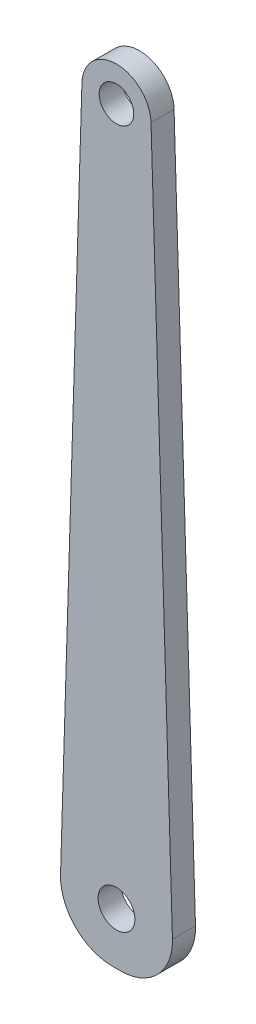
ISO-10303-21;
HEADER;
FILE_DESCRIPTION(('STEP AP214'),'2;1');
FILE_NAME('part.step','',(''),(''),'','','');
FILE_SCHEMA(('AUTOMOTIVE_DESIGN { 1 0 10303 214 1 1 1 1 }'));
ENDSEC;
DATA;
#1=APPLICATION_CONTEXT('core data for automotive mechanical design processes');
#2=APPLICATION_PROTOCOL_DEFINITION('international standard','automotive_design',2000,#1);
#3=PRODUCT_CONTEXT('',#1,'mechanical');
#4=PRODUCT('Part','Part','',(#3));
#5=PRODUCT_RELATED_PRODUCT_CATEGORY('part','',(#4));
#6=PRODUCT_DEFINITION_FORMATION('','',#4);
#7=PRODUCT_DEFINITION_CONTEXT('part definition',#1,'design');
#8=PRODUCT_DEFINITION('design','',#6,#7);
#9=PRODUCT_DEFINITION_SHAPE('','',#8);
#10=(LENGTH_UNIT() NAMED_UNIT(*) SI_UNIT(.MILLI.,.METRE.));
#11=(NAMED_UNIT(*) PLANE_ANGLE_UNIT() SI_UNIT($,.RADIAN.));
#12=(NAMED_UNIT(*) SI_UNIT($,.STERADIAN.) SOLID_ANGLE_UNIT());
#13=UNCERTAINTY_MEASURE_WITH_UNIT(LENGTH_MEASURE(1.E-05),#10,'distance_accuracy_value','');
#14=(GEOMETRIC_REPRESENTATION_CONTEXT(3) GLOBAL_UNCERTAINTY_ASSIGNED_CONTEXT((#13)) GLOBAL_UNIT_ASSIGNED_CONTEXT((#10,
#11,#12)) REPRESENTATION_CONTEXT('',''));
#15=CARTESIAN_POINT('',(0.,0.,0.));
#16=DIRECTION('',(0.,0.,1.));
#17=DIRECTION('',(1.,0.,0.));
#18=AXIS2_PLACEMENT_3D('',#15,#16,#17);
#19=CARTESIAN_POINT('',(0.,0.,-20.));
#20=DIRECTION('',(-0.999527633021855,0.0307328948478349,0.));
#21=DIRECTION('',(-0.0307328948478349,-0.999527633021855,0.));
#22=AXIS2_PLACEMENT_3D('',#19,#20,#21);
#23=PLANE('',#22);
#24=DIRECTION('',(-0.0307328948478349,-0.999527633021855,0.));
#25=VECTOR('',#24,1.);
#26=CARTESIAN_POINT('',(0.,0.,-20.));
#27=LINE('',#26,#25);
#28=CARTESIAN_POINT('',(20.0141710093443,650.921986845435,-20.));
#29=VERTEX_POINT('',#28);
#30=CARTESIAN_POINT('',(1.42615692474724,46.3829802681526,-20.));
#31=VERTEX_POINT('',#30);
#32=EDGE_CURVE('E112',#29,#31,#27,.T.);
#33=ORIENTED_EDGE('',*,*,#32,.T.);
#34=DIRECTION('',(0.,0.,1.));
#35=VECTOR('',#34,1.);
#36=CARTESIAN_POINT('',(1.42615692474724,46.3829802681526,-20.));
#37=LINE('',#36,#35);
#38=CARTESIAN_POINT('',(1.42615692474724,46.3829802681526,0.));
#39=VERTEX_POINT('',#38);
#40=EDGE_CURVE('E11',#31,#39,#37,.T.);
#41=ORIENTED_EDGE('',*,*,#40,.T.);
#42=DIRECTION('',(-0.0307328948478349,-0.999527633021855,0.));
#43=VECTOR('',#42,1.);
#44=CARTESIAN_POINT('',(0.,0.,0.));
#45=LINE('',#44,#43);
#46=CARTESIAN_POINT('',(20.0141710093443,650.921986845435,0.));
#47=VERTEX_POINT('',#46);
#48=EDGE_CURVE('E116',#47,#39,#45,.T.);
#49=ORIENTED_EDGE('',*,*,#48,.F.);
#50=DIRECTION('',(0.,0.,1.));
#51=VECTOR('',#50,1.);
#52=CARTESIAN_POINT('',(20.0141710093443,650.921986845435,-20.));
#53=LINE('',#52,#51);
#54=EDGE_CURVE('E109',#29,#47,#53,.T.);
#55=ORIENTED_EDGE('',*,*,#54,.F.);
#56=EDGE_LOOP('',(#33,#41,#49,#55));
#57=FACE_BOUND('',#56,.T.);
#58=ADVANCED_FACE('F40',(#57),#23,.T.);
#59=CARTESIAN_POINT('',(49.9999999999999,650.,-20.));
#60=DIRECTION('',(0.,0.,1.));
#61=DIRECTION('',(1.,0.,0.));
#62=AXIS2_PLACEMENT_3D('',#59,#60,#61);
#63=CYLINDRICAL_SURFACE('',#62,30.);
#64=CARTESIAN_POINT('',(49.9999999999999,650.,0.));
#65=DIRECTION('',(0.,0.,1.));
#66=DIRECTION('',(1.,0.,0.));
#67=AXIS2_PLACEMENT_3D('',#64,#65,#66);
#68=CIRCLE('',#67,30.);
#69=CARTESIAN_POINT('',(79.9858289906555,650.921986845435,0.));
#70=VERTEX_POINT('',#69);
#71=EDGE_CURVE('E108',#70,#47,#68,.T.);
#72=ORIENTED_EDGE('',*,*,#71,.F.);
#73=DIRECTION('',(0.,0.,1.));
#74=VECTOR('',#73,1.);
#75=CARTESIAN_POINT('',(79.9858289906555,650.921986845435,-20.));
#76=LINE('',#75,#74);
#77=CARTESIAN_POINT('',(79.9858289906555,650.921986845435,-20.));
#78=VERTEX_POINT('',#77);
#79=EDGE_CURVE('E97',#78,#70,#76,.T.);
#80=ORIENTED_EDGE('',*,*,#79,.F.);
#81=CARTESIAN_POINT('',(49.9999999999999,650.,-20.));
#82=DIRECTION('',(0.,0.,1.));
#83=DIRECTION('',(1.,0.,0.));
#84=AXIS2_PLACEMENT_3D('',#81,#82,#83);
#85=CIRCLE('',#84,30.);
#86=EDGE_CURVE('E101',#78,#29,#85,.T.);
#87=ORIENTED_EDGE('',*,*,#86,.T.);
#88=ORIENTED_EDGE('',*,*,#54,.T.);
#89=EDGE_LOOP('',(#72,#80,#87,#88));
#90=FACE_BOUND('',#89,.T.);
#91=ADVANCED_FACE('F106',(#90),#63,.T.);
#92=CARTESIAN_POINT('',(100.,0.,-20.));
#93=DIRECTION('',(0.999527633021855,0.0307328948478351,0.));
#94=DIRECTION('',(-0.0307328948478351,0.999527633021855,0.));
#95=AXIS2_PLACEMENT_3D('',#92,#93,#94);
#96=PLANE('',#95);
#97=DIRECTION('',(-0.0307328948478351,0.999527633021855,0.));
#98=VECTOR('',#97,1.);
#99=CARTESIAN_POINT('',(100.,0.,0.));
#100=LINE('',#99,#98);
#101=CARTESIAN_POINT('',(98.5738430752528,46.3829802681526,0.));
#102=VERTEX_POINT('',#101);
#103=EDGE_CURVE('E123',#102,#70,#100,.T.);
#104=ORIENTED_EDGE('',*,*,#103,.F.);
#105=DIRECTION('',(0.,0.,1.));
#106=VECTOR('',#105,1.);
#107=CARTESIAN_POINT('',(98.5738430752528,46.3829802681526,-20.));
#108=LINE('',#107,#106);
#109=CARTESIAN_POINT('',(98.5738430752528,46.3829802681526,-20.));
#110=VERTEX_POINT('',#109);
#111=EDGE_CURVE('E63',#102,#110,#108,.F.);
#112=ORIENTED_EDGE('',*,*,#111,.T.);
#113=DIRECTION('',(-0.0307328948478351,0.999527633021855,0.));
#114=VECTOR('',#113,1.);
#115=CARTESIAN_POINT('',(100.,0.,-20.));
#116=LINE('',#115,#114);
#117=EDGE_CURVE('E94',#110,#78,#116,.T.);
#118=ORIENTED_EDGE('',*,*,#117,.T.);
#119=ORIENTED_EDGE('',*,*,#79,.T.);
#120=EDGE_LOOP('',(#104,#112,#118,#119));
#121=FACE_BOUND('',#120,.T.);
#122=ADVANCED_FACE('F96',(#121),#96,.T.);
#123=CARTESIAN_POINT('',(0.,0.,-20.));
#124=DIRECTION('',(0.,-1.,0.));
#125=DIRECTION('',(0.,0.,-1.));
#126=AXIS2_PLACEMENT_3D('',#123,#124,#125);
#127=PLANE('',#126);
#128=DIRECTION('',(1.,0.,0.));
#129=VECTOR('',#128,1.);
#130=CARTESIAN_POINT('',(0.,0.,-20.));
#131=LINE('',#130,#129);
#132=CARTESIAN_POINT('',(46.4049004107307,0.,-20.));
#133=VERTEX_POINT('',#132);
#134=CARTESIAN_POINT('',(53.5950995892693,0.,-20.));
#135=VERTEX_POINT('',#134);
#136=EDGE_CURVE('E102',#133,#135,#131,.T.);
#137=ORIENTED_EDGE('',*,*,#136,.T.);
#138=DIRECTION('',(0.,0.,1.));
#139=VECTOR('',#138,1.);
#140=CARTESIAN_POINT('',(53.5950995892693,0.,-20.));
#141=LINE('',#140,#139);
#142=CARTESIAN_POINT('',(53.5950995892693,0.,0.));
#143=VERTEX_POINT('',#142);
#144=EDGE_CURVE('E129',#135,#143,#141,.T.);
#145=ORIENTED_EDGE('',*,*,#144,.T.);
#146=DIRECTION('',(1.,0.,0.));
#147=VECTOR('',#146,1.);
#148=CARTESIAN_POINT('',(0.,0.,0.));
#149=LINE('',#148,#147);
#150=CARTESIAN_POINT('',(46.4049004107307,0.,0.));
#151=VERTEX_POINT('',#150);
#152=EDGE_CURVE('E119',#151,#143,#149,.T.);
#153=ORIENTED_EDGE('',*,*,#152,.F.);
#154=DIRECTION('',(0.,0.,1.));
#155=VECTOR('',#154,1.);
#156=CARTESIAN_POINT('',(46.4049004107307,0.,-20.));
#157=LINE('',#156,#155);
#158=EDGE_CURVE('E126',#151,#133,#157,.F.);
#159=ORIENTED_EDGE('',*,*,#158,.T.);
#160=EDGE_LOOP('',(#137,#145,#153,#159));
#161=FACE_BOUND('',#160,.T.);
#162=ADVANCED_FACE('F141',(#161),#127,.T.);
#163=CARTESIAN_POINT('',(49.9999999999999,650.,-20.));
#164=DIRECTION('',(0.,0.,1.));
#165=DIRECTION('',(1.,0.,0.));
#166=AXIS2_PLACEMENT_3D('',#163,#164,#165);
#167=PLANE('',#166);
#168=CARTESIAN_POINT('',(50.,45.,-20.));
#169=DIRECTION('',(0.,0.,1.));
#170=DIRECTION('',(1.,0.,0.));
#171=AXIS2_PLACEMENT_3D('',#168,#169,#170);
#172=CIRCLE('',#171,16.);
#173=CARTESIAN_POINT('',(66.,45.,-20.));
#174=VERTEX_POINT('',#173);
#175=EDGE_CURVE('E156',#174,#174,#172,.T.);
#176=ORIENTED_EDGE('',*,*,#175,.T.);
#177=EDGE_LOOP('',(#176));
#178=FACE_BOUND('',#177,.T.);
#179=CARTESIAN_POINT('',(49.9999999999999,650.,-20.));
#180=DIRECTION('',(0.,0.,1.));
#181=DIRECTION('',(1.,0.,0.));
#182=AXIS2_PLACEMENT_3D('',#179,#180,#181);
#183=CIRCLE('',#182,15.);
#184=CARTESIAN_POINT('',(64.9999999999999,650.,-20.));
#185=VERTEX_POINT('',#184);
#186=EDGE_CURVE('E120',#185,#185,#183,.T.);
#187=ORIENTED_EDGE('',*,*,#186,.T.);
#188=EDGE_LOOP('',(#187));
#189=FACE_BOUND('',#188,.T.);
#190=ORIENTED_EDGE('',*,*,#117,.F.);
#191=CARTESIAN_POINT('',(53.5950995892693,45.,-20.));
#192=DIRECTION('',(0.,0.,1.));
#193=DIRECTION('',(1.,0.,0.));
#194=AXIS2_PLACEMENT_3D('',#191,#192,#193);
#195=CIRCLE('',#194,45.);
#196=EDGE_CURVE('E48',#110,#135,#195,.F.);
#197=ORIENTED_EDGE('',*,*,#196,.T.);
#198=ORIENTED_EDGE('',*,*,#136,.F.);
#199=CARTESIAN_POINT('',(46.4049004107307,45.,-20.));
#200=DIRECTION('',(0.,0.,1.));
#201=DIRECTION('',(1.,0.,0.));
#202=AXIS2_PLACEMENT_3D('',#199,#200,#201);
#203=CIRCLE('',#202,45.);
#204=EDGE_CURVE('E55',#133,#31,#203,.F.);
#205=ORIENTED_EDGE('',*,*,#204,.T.);
#206=ORIENTED_EDGE('',*,*,#32,.F.);
#207=ORIENTED_EDGE('',*,*,#86,.F.);
#208=EDGE_LOOP('',(#190,#197,#198,#205,#206,#207));
#209=FACE_BOUND('',#208,.T.);
#210=ADVANCED_FACE('F111',(#178,#189,#209),#167,.F.);
#211=CARTESIAN_POINT('',(49.9999999999999,650.,0.));
#212=DIRECTION('',(0.,0.,1.));
#213=DIRECTION('',(1.,0.,0.));
#214=AXIS2_PLACEMENT_3D('',#211,#212,#213);
#215=PLANE('',#214);
#216=CARTESIAN_POINT('',(50.,45.,0.));
#217=DIRECTION('',(0.,0.,1.));
#218=DIRECTION('',(1.,0.,0.));
#219=AXIS2_PLACEMENT_3D('',#216,#217,#218);
#220=CIRCLE('',#219,16.);
#221=CARTESIAN_POINT('',(66.,45.,0.));
#222=VERTEX_POINT('',#221);
#223=EDGE_CURVE('E159',#222,#222,#220,.T.);
#224=ORIENTED_EDGE('',*,*,#223,.F.);
#225=EDGE_LOOP('',(#224));
#226=FACE_BOUND('',#225,.T.);
#227=CARTESIAN_POINT('',(49.9999999999999,650.,0.));
#228=DIRECTION('',(0.,0.,1.));
#229=DIRECTION('',(1.,0.,0.));
#230=AXIS2_PLACEMENT_3D('',#227,#228,#229);
#231=CIRCLE('',#230,15.);
#232=CARTESIAN_POINT('',(64.9999999999999,650.,0.));
#233=VERTEX_POINT('',#232);
#234=EDGE_CURVE('E153',#233,#233,#231,.T.);
#235=ORIENTED_EDGE('',*,*,#234,.F.);
#236=EDGE_LOOP('',(#235));
#237=FACE_BOUND('',#236,.T.);
#238=ORIENTED_EDGE('',*,*,#152,.T.);
#239=CARTESIAN_POINT('',(53.5950995892693,45.,0.));
#240=DIRECTION('',(0.,0.,1.));
#241=DIRECTION('',(1.,0.,0.));
#242=AXIS2_PLACEMENT_3D('',#239,#240,#241);
#243=CIRCLE('',#242,45.);
#244=EDGE_CURVE('E134',#143,#102,#243,.T.);
#245=ORIENTED_EDGE('',*,*,#244,.T.);
#246=ORIENTED_EDGE('',*,*,#103,.T.);
#247=ORIENTED_EDGE('',*,*,#71,.T.);
#248=ORIENTED_EDGE('',*,*,#48,.T.);
#249=CARTESIAN_POINT('',(46.4049004107307,45.,0.));
#250=DIRECTION('',(0.,0.,1.));
#251=DIRECTION('',(1.,0.,0.));
#252=AXIS2_PLACEMENT_3D('',#249,#250,#251);
#253=CIRCLE('',#252,45.);
#254=EDGE_CURVE('E132',#39,#151,#253,.T.);
#255=ORIENTED_EDGE('',*,*,#254,.T.);
#256=EDGE_LOOP('',(#238,#245,#246,#247,#248,#255));
#257=FACE_BOUND('',#256,.T.);
#258=ADVANCED_FACE('F146',(#226,#237,#257),#215,.T.);
#259=CARTESIAN_POINT('',(49.9999999999999,650.,-20.));
#260=DIRECTION('',(0.,0.,1.));
#261=DIRECTION('',(1.,0.,0.));
#262=AXIS2_PLACEMENT_3D('',#259,#260,#261);
#263=CYLINDRICAL_SURFACE('',#262,15.);
#264=ORIENTED_EDGE('',*,*,#186,.F.);
#265=EDGE_LOOP('',(#264));
#266=FACE_BOUND('',#265,.T.);
#267=ORIENTED_EDGE('',*,*,#234,.T.);
#268=EDGE_LOOP('',(#267));
#269=FACE_BOUND('',#268,.T.);
#270=ADVANCED_FACE('F170',(#266,#269),#263,.F.);
#271=CARTESIAN_POINT('',(50.,45.,-20.));
#272=DIRECTION('',(0.,0.,1.));
#273=DIRECTION('',(1.,0.,0.));
#274=AXIS2_PLACEMENT_3D('',#271,#272,#273);
#275=CYLINDRICAL_SURFACE('',#274,16.);
#276=ORIENTED_EDGE('',*,*,#175,.F.);
#277=EDGE_LOOP('',(#276));
#278=FACE_BOUND('',#277,.T.);
#279=ORIENTED_EDGE('',*,*,#223,.T.);
#280=EDGE_LOOP('',(#279));
#281=FACE_BOUND('',#280,.T.);
#282=ADVANCED_FACE('F167',(#278,#281),#275,.F.);
#283=CARTESIAN_POINT('',(53.5950995892693,45.,-20.));
#284=DIRECTION('',(0.,0.,1.));
#285=DIRECTION('',(1.,0.,0.));
#286=AXIS2_PLACEMENT_3D('',#283,#284,#285);
#287=CYLINDRICAL_SURFACE('',#286,45.);
#288=ORIENTED_EDGE('',*,*,#196,.F.);
#289=ORIENTED_EDGE('',*,*,#111,.F.);
#290=ORIENTED_EDGE('',*,*,#244,.F.);
#291=ORIENTED_EDGE('',*,*,#144,.F.);
#292=EDGE_LOOP('',(#288,#289,#290,#291));
#293=FACE_BOUND('',#292,.T.);
#294=ADVANCED_FACE('F144',(#293),#287,.T.);
#295=CARTESIAN_POINT('',(46.4049004107307,45.,-20.));
#296=DIRECTION('',(0.,0.,1.));
#297=DIRECTION('',(1.,0.,0.));
#298=AXIS2_PLACEMENT_3D('',#295,#296,#297);
#299=CYLINDRICAL_SURFACE('',#298,45.);
#300=ORIENTED_EDGE('',*,*,#204,.F.);
#301=ORIENTED_EDGE('',*,*,#158,.F.);
#302=ORIENTED_EDGE('',*,*,#254,.F.);
#303=ORIENTED_EDGE('',*,*,#40,.F.);
#304=EDGE_LOOP('',(#300,#301,#302,#303));
#305=FACE_BOUND('',#304,.T.);
#306=ADVANCED_FACE('F42',(#305),#299,.T.);
#307=CLOSED_SHELL('',(#58,#91,#122,#162,#210,#258,#270,#282,#294,#306));
#308=MANIFOLD_SOLID_BREP('B2',#307);
#309=ADVANCED_BREP_SHAPE_REPRESENTATION('',(#18,#308),#14);
#310=SHAPE_DEFINITION_REPRESENTATION(#9,#309);
ENDSEC;
END-ISO-10303-21;
